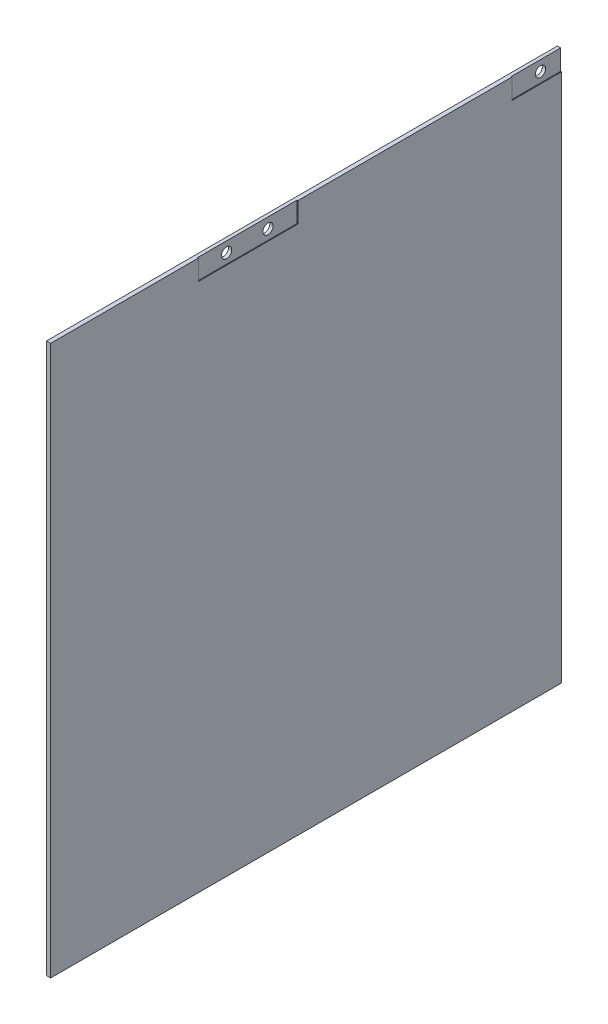
ISO-10303-21;
HEADER;
FILE_DESCRIPTION(('STEP AP214'),'2;1');
FILE_NAME('part.step','',(''),(''),'','','');
FILE_SCHEMA(('AUTOMOTIVE_DESIGN { 1 0 10303 214 1 1 1 1 }'));
ENDSEC;
DATA;
#1=APPLICATION_CONTEXT('core data for automotive mechanical design processes');
#2=APPLICATION_PROTOCOL_DEFINITION('international standard','automotive_design',2000,#1);
#3=PRODUCT_CONTEXT('',#1,'mechanical');
#4=PRODUCT('Part','Part','',(#3));
#5=PRODUCT_RELATED_PRODUCT_CATEGORY('part','',(#4));
#6=PRODUCT_DEFINITION_FORMATION('','',#4);
#7=PRODUCT_DEFINITION_CONTEXT('part definition',#1,'design');
#8=PRODUCT_DEFINITION('design','',#6,#7);
#9=PRODUCT_DEFINITION_SHAPE('','',#8);
#10=(LENGTH_UNIT() NAMED_UNIT(*) SI_UNIT(.MILLI.,.METRE.));
#11=(NAMED_UNIT(*) PLANE_ANGLE_UNIT() SI_UNIT($,.RADIAN.));
#12=(NAMED_UNIT(*) SI_UNIT($,.STERADIAN.) SOLID_ANGLE_UNIT());
#13=UNCERTAINTY_MEASURE_WITH_UNIT(LENGTH_MEASURE(1.E-05),#10,'distance_accuracy_value','');
#14=(GEOMETRIC_REPRESENTATION_CONTEXT(3) GLOBAL_UNCERTAINTY_ASSIGNED_CONTEXT((#13)) GLOBAL_UNIT_ASSIGNED_CONTEXT((#10,
#11,#12)) REPRESENTATION_CONTEXT('',''));
#15=CARTESIAN_POINT('',(0.,0.,0.));
#16=DIRECTION('',(0.,0.,1.));
#17=DIRECTION('',(1.,0.,0.));
#18=AXIS2_PLACEMENT_3D('',#15,#16,#17);
#19=CARTESIAN_POINT('',(160.,100.,-105.55));
#20=DIRECTION('',(-1.,0.,0.));
#21=DIRECTION('',(0.,0.,1.));
#22=AXIS2_PLACEMENT_3D('',#19,#20,#21);
#23=PLANE('',#22);
#24=DIRECTION('',(0.,-1.,0.));
#25=VECTOR('',#24,1.);
#26=CARTESIAN_POINT('',(160.,100.,79.4));
#27=LINE('',#26,#25);
#28=CARTESIAN_POINT('',(160.,100.,79.4));
#29=VERTEX_POINT('',#28);
#30=CARTESIAN_POINT('',(160.,-99.,79.4));
#31=VERTEX_POINT('',#30);
#32=EDGE_CURVE('E163',#29,#31,#27,.T.);
#33=ORIENTED_EDGE('',*,*,#32,.T.);
#34=DIRECTION('',(0.,0.,-1.));
#35=VECTOR('',#34,1.);
#36=CARTESIAN_POINT('',(160.,-99.,81.202775637732));
#37=LINE('',#36,#35);
#38=CARTESIAN_POINT('',(160.,-99.,-105.55));
#39=VERTEX_POINT('',#38);
#40=EDGE_CURVE('E48',#31,#39,#37,.T.);
#41=ORIENTED_EDGE('',*,*,#40,.T.);
#42=DIRECTION('',(0.,-1.,0.));
#43=VECTOR('',#42,1.);
#44=CARTESIAN_POINT('',(160.,100.,-105.55));
#45=LINE('',#44,#43);
#46=CARTESIAN_POINT('',(160.,92.65,-105.55));
#47=VERTEX_POINT('',#46);
#48=EDGE_CURVE('E165',#47,#39,#45,.T.);
#49=ORIENTED_EDGE('',*,*,#48,.F.);
#50=DIRECTION('',(0.,0.,-1.));
#51=VECTOR('',#50,1.);
#52=CARTESIAN_POINT('',(160.,92.65,-123.8));
#53=LINE('',#52,#51);
#54=CARTESIAN_POINT('',(160.,92.65,-87.7));
#55=VERTEX_POINT('',#54);
#56=EDGE_CURVE('E222',#55,#47,#53,.T.);
#57=ORIENTED_EDGE('',*,*,#56,.F.);
#58=DIRECTION('',(0.,-1.,0.));
#59=VECTOR('',#58,1.);
#60=CARTESIAN_POINT('',(160.,108.85,-87.7));
#61=LINE('',#60,#59);
#62=CARTESIAN_POINT('',(160.,100.,-87.7));
#63=VERTEX_POINT('',#62);
#64=EDGE_CURVE('E220',#63,#55,#61,.T.);
#65=ORIENTED_EDGE('',*,*,#64,.F.);
#66=DIRECTION('',(0.,0.,1.));
#67=VECTOR('',#66,1.);
#68=CARTESIAN_POINT('',(160.,100.,-105.55));
#69=LINE('',#68,#67);
#70=CARTESIAN_POINT('',(160.,100.,-10.15));
#71=VERTEX_POINT('',#70);
#72=EDGE_CURVE('E173',#63,#71,#69,.T.);
#73=ORIENTED_EDGE('',*,*,#72,.T.);
#74=DIRECTION('',(0.,1.,0.));
#75=VECTOR('',#74,1.);
#76=CARTESIAN_POINT('',(160.,108.85,-10.15));
#77=LINE('',#76,#75);
#78=CARTESIAN_POINT('',(160.,92.65,-10.15));
#79=VERTEX_POINT('',#78);
#80=EDGE_CURVE('E218',#79,#71,#77,.T.);
#81=ORIENTED_EDGE('',*,*,#80,.F.);
#82=DIRECTION('',(0.,0.,-1.));
#83=VECTOR('',#82,1.);
#84=CARTESIAN_POINT('',(160.,92.65,-10.15));
#85=LINE('',#84,#83);
#86=CARTESIAN_POINT('',(160.,92.65,25.95));
#87=VERTEX_POINT('',#86);
#88=EDGE_CURVE('E239',#87,#79,#85,.T.);
#89=ORIENTED_EDGE('',*,*,#88,.F.);
#90=DIRECTION('',(0.,-1.,0.));
#91=VECTOR('',#90,1.);
#92=CARTESIAN_POINT('',(160.,108.85,25.95));
#93=LINE('',#92,#91);
#94=CARTESIAN_POINT('',(160.,100.,25.95));
#95=VERTEX_POINT('',#94);
#96=EDGE_CURVE('E244',#95,#87,#93,.T.);
#97=ORIENTED_EDGE('',*,*,#96,.F.);
#98=EDGE_CURVE('E171',#95,#29,#69,.T.);
#99=ORIENTED_EDGE('',*,*,#98,.T.);
#100=EDGE_LOOP('',(#33,#41,#49,#57,#65,#73,#81,#89,#97,#99));
#101=FACE_BOUND('',#100,.T.);
#102=ADVANCED_FACE('F33',(#101),#23,.F.);
#103=CARTESIAN_POINT('',(158.5,100.,-105.55));
#104=DIRECTION('',(1.,0.,0.));
#105=DIRECTION('',(0.,1.,0.));
#106=AXIS2_PLACEMENT_3D('',#103,#104,#105);
#107=PLANE('',#106);
#108=CARTESIAN_POINT('',(158.5,96.25,-98.25));
#109=DIRECTION('',(1.,0.,0.));
#110=DIRECTION('',(0.,1.,0.));
#111=AXIS2_PLACEMENT_3D('',#108,#109,#110);
#112=CIRCLE('',#111,1.85000000000001);
#113=CARTESIAN_POINT('',(158.5,98.1,-98.25));
#114=VERTEX_POINT('',#113);
#115=EDGE_CURVE('E188',#114,#114,#112,.T.);
#116=ORIENTED_EDGE('',*,*,#115,.T.);
#117=EDGE_LOOP('',(#116));
#118=FACE_BOUND('',#117,.T.);
#119=CARTESIAN_POINT('',(158.5,96.25,0.400000000000005));
#120=DIRECTION('',(1.,0.,0.));
#121=DIRECTION('',(0.,1.,0.));
#122=AXIS2_PLACEMENT_3D('',#119,#120,#121);
#123=CIRCLE('',#122,1.85);
#124=CARTESIAN_POINT('',(158.5,98.1,0.400000000000005));
#125=VERTEX_POINT('',#124);
#126=EDGE_CURVE('E184',#125,#125,#123,.T.);
#127=ORIENTED_EDGE('',*,*,#126,.T.);
#128=EDGE_LOOP('',(#127));
#129=FACE_BOUND('',#128,.T.);
#130=CARTESIAN_POINT('',(158.5,96.25,15.4));
#131=DIRECTION('',(1.,0.,0.));
#132=DIRECTION('',(0.,1.,0.));
#133=AXIS2_PLACEMENT_3D('',#130,#131,#132);
#134=CIRCLE('',#133,1.85);
#135=CARTESIAN_POINT('',(158.5,98.1,15.4));
#136=VERTEX_POINT('',#135);
#137=EDGE_CURVE('E181',#136,#136,#134,.T.);
#138=ORIENTED_EDGE('',*,*,#137,.T.);
#139=EDGE_LOOP('',(#138));
#140=FACE_BOUND('',#139,.T.);
#141=DIRECTION('',(0.,1.,0.));
#142=VECTOR('',#141,1.);
#143=CARTESIAN_POINT('',(158.5,100.,-105.55));
#144=LINE('',#143,#142);
#145=CARTESIAN_POINT('',(158.5,-99.,-105.55));
#146=VERTEX_POINT('',#145);
#147=CARTESIAN_POINT('',(158.5,-25.,-105.55));
#148=VERTEX_POINT('',#147);
#149=EDGE_CURVE('E156',#146,#148,#144,.T.);
#150=ORIENTED_EDGE('',*,*,#149,.F.);
#151=DIRECTION('',(0.,0.,-1.));
#152=VECTOR('',#151,1.);
#153=CARTESIAN_POINT('',(158.5,-99.,81.202775637732));
#154=LINE('',#153,#152);
#155=CARTESIAN_POINT('',(158.5,-99.,79.4));
#156=VERTEX_POINT('',#155);
#157=EDGE_CURVE('E141',#156,#146,#154,.T.);
#158=ORIENTED_EDGE('',*,*,#157,.F.);
#159=DIRECTION('',(0.,1.,0.));
#160=VECTOR('',#159,1.);
#161=CARTESIAN_POINT('',(158.5,100.,79.4));
#162=LINE('',#161,#160);
#163=CARTESIAN_POINT('',(158.5,100.,79.4));
#164=VERTEX_POINT('',#163);
#165=EDGE_CURVE('E153',#156,#164,#162,.T.);
#166=ORIENTED_EDGE('',*,*,#165,.T.);
#167=DIRECTION('',(0.,0.,1.));
#168=VECTOR('',#167,1.);
#169=CARTESIAN_POINT('',(158.5,100.,-105.55));
#170=LINE('',#169,#168);
#171=CARTESIAN_POINT('',(158.5,100.,-105.55));
#172=VERTEX_POINT('',#171);
#173=EDGE_CURVE('E175',#172,#164,#170,.T.);
#174=ORIENTED_EDGE('',*,*,#173,.F.);
#175=CARTESIAN_POINT('',(158.5,25.,-105.55));
#176=VERTEX_POINT('',#175);
#177=EDGE_CURVE('E281',#176,#172,#144,.T.);
#178=ORIENTED_EDGE('',*,*,#177,.F.);
#179=DIRECTION('',(0.,0.,1.));
#180=VECTOR('',#179,1.);
#181=CARTESIAN_POINT('',(158.5,25.,-105.55));
#182=LINE('',#181,#180);
#183=CARTESIAN_POINT('',(158.5,25.,-104.05));
#184=VERTEX_POINT('',#183);
#185=EDGE_CURVE('E274',#176,#184,#182,.T.);
#186=ORIENTED_EDGE('',*,*,#185,.T.);
#187=DIRECTION('',(0.,-1.,0.));
#188=VECTOR('',#187,1.);
#189=CARTESIAN_POINT('',(158.5,100.,-104.05));
#190=LINE('',#189,#188);
#191=CARTESIAN_POINT('',(158.5,-25.,-104.05));
#192=VERTEX_POINT('',#191);
#193=EDGE_CURVE('E177',#184,#192,#190,.T.);
#194=ORIENTED_EDGE('',*,*,#193,.T.);
#195=DIRECTION('',(0.,0.,-1.));
#196=VECTOR('',#195,1.);
#197=CARTESIAN_POINT('',(158.5,-25.,-105.55));
#198=LINE('',#197,#196);
#199=EDGE_CURVE('E167',#192,#148,#198,.T.);
#200=ORIENTED_EDGE('',*,*,#199,.T.);
#201=EDGE_LOOP('',(#150,#158,#166,#174,#178,#186,#194,#200));
#202=FACE_BOUND('',#201,.T.);
#203=ADVANCED_FACE('F151',(#118,#129,#140,#202),#107,.F.);
#204=CARTESIAN_POINT('',(160.,100.,-105.55));
#205=DIRECTION('',(0.,-1.,0.));
#206=DIRECTION('',(0.,0.,-1.));
#207=AXIS2_PLACEMENT_3D('',#204,#205,#206);
#208=PLANE('',#207);
#209=ORIENTED_EDGE('',*,*,#72,.F.);
#210=DIRECTION('',(-1.,0.,0.));
#211=VECTOR('',#210,1.);
#212=CARTESIAN_POINT('',(160.,100.,-87.7));
#213=LINE('',#212,#211);
#214=CARTESIAN_POINT('',(159.7,100.,-87.7));
#215=VERTEX_POINT('',#214);
#216=EDGE_CURVE('E11',#63,#215,#213,.T.);
#217=ORIENTED_EDGE('',*,*,#216,.T.);
#218=DIRECTION('',(0.,0.,-1.));
#219=VECTOR('',#218,1.);
#220=CARTESIAN_POINT('',(159.7,100.,-105.55));
#221=LINE('',#220,#219);
#222=CARTESIAN_POINT('',(159.7,100.,-105.55));
#223=VERTEX_POINT('',#222);
#224=EDGE_CURVE('E201',#215,#223,#221,.T.);
#225=ORIENTED_EDGE('',*,*,#224,.T.);
#226=DIRECTION('',(1.,0.,0.));
#227=VECTOR('',#226,1.);
#228=CARTESIAN_POINT('',(160.,100.,-105.55));
#229=LINE('',#228,#227);
#230=EDGE_CURVE('E174',#172,#223,#229,.T.);
#231=ORIENTED_EDGE('',*,*,#230,.F.);
#232=ORIENTED_EDGE('',*,*,#173,.T.);
#233=DIRECTION('',(1.,0.,0.));
#234=VECTOR('',#233,1.);
#235=CARTESIAN_POINT('',(160.,100.,79.4));
#236=LINE('',#235,#234);
#237=EDGE_CURVE('E162',#164,#29,#236,.T.);
#238=ORIENTED_EDGE('',*,*,#237,.T.);
#239=ORIENTED_EDGE('',*,*,#98,.F.);
#240=DIRECTION('',(-1.,0.,0.));
#241=VECTOR('',#240,1.);
#242=CARTESIAN_POINT('',(160.,100.,25.95));
#243=LINE('',#242,#241);
#244=CARTESIAN_POINT('',(159.7,100.,25.95));
#245=VERTEX_POINT('',#244);
#246=EDGE_CURVE('E204',#95,#245,#243,.T.);
#247=ORIENTED_EDGE('',*,*,#246,.T.);
#248=DIRECTION('',(0.,0.,-1.));
#249=VECTOR('',#248,1.);
#250=CARTESIAN_POINT('',(159.7,100.,-105.55));
#251=LINE('',#250,#249);
#252=CARTESIAN_POINT('',(159.7,100.,-10.15));
#253=VERTEX_POINT('',#252);
#254=EDGE_CURVE('E185',#245,#253,#251,.T.);
#255=ORIENTED_EDGE('',*,*,#254,.T.);
#256=DIRECTION('',(1.,0.,0.));
#257=VECTOR('',#256,1.);
#258=CARTESIAN_POINT('',(160.,100.,-10.15));
#259=LINE('',#258,#257);
#260=EDGE_CURVE('E41',#253,#71,#259,.T.);
#261=ORIENTED_EDGE('',*,*,#260,.T.);
#262=EDGE_LOOP('',(#209,#217,#225,#231,#232,#238,#239,#247,#255,#261));
#263=FACE_BOUND('',#262,.T.);
#264=ADVANCED_FACE('F212',(#263),#208,.F.);
#265=CARTESIAN_POINT('',(0.,0.,-105.55));
#266=DIRECTION('',(0.,0.,-1.));
#267=DIRECTION('',(-1.,0.,0.));
#268=AXIS2_PLACEMENT_3D('',#265,#266,#267);
#269=PLANE('',#268);
#270=CARTESIAN_POINT('',(150.4,0.,-105.55));
#271=DIRECTION('',(0.,0.,-1.));
#272=DIRECTION('',(-1.,0.,0.));
#273=AXIS2_PLACEMENT_3D('',#270,#271,#272);
#274=CIRCLE('',#273,1.80000000000001);
#275=CARTESIAN_POINT('',(148.6,0.,-105.55));
#276=VERTEX_POINT('',#275);
#277=EDGE_CURVE('E157',#276,#276,#274,.T.);
#278=ORIENTED_EDGE('',*,*,#277,.F.);
#279=EDGE_LOOP('',(#278));
#280=FACE_BOUND('',#279,.T.);
#281=DIRECTION('',(1.,0.,0.));
#282=VECTOR('',#281,1.);
#283=CARTESIAN_POINT('',(0.,-99.,-105.55));
#284=LINE('',#283,#282);
#285=EDGE_CURVE('E147',#146,#39,#284,.T.);
#286=ORIENTED_EDGE('',*,*,#285,.F.);
#287=ORIENTED_EDGE('',*,*,#149,.T.);
#288=DIRECTION('',(-1.,0.,0.));
#289=VECTOR('',#288,1.);
#290=CARTESIAN_POINT('',(142.9,-25.,-105.55));
#291=LINE('',#290,#289);
#292=CARTESIAN_POINT('',(142.9,-25.,-105.55));
#293=VERTEX_POINT('',#292);
#294=EDGE_CURVE('E260',#148,#293,#291,.T.);
#295=ORIENTED_EDGE('',*,*,#294,.T.);
#296=DIRECTION('',(0.,1.,0.));
#297=VECTOR('',#296,1.);
#298=CARTESIAN_POINT('',(142.9,25.,-105.55));
#299=LINE('',#298,#297);
#300=CARTESIAN_POINT('',(142.9,25.,-105.55));
#301=VERTEX_POINT('',#300);
#302=EDGE_CURVE('E191',#293,#301,#299,.T.);
#303=ORIENTED_EDGE('',*,*,#302,.T.);
#304=DIRECTION('',(1.,0.,0.));
#305=VECTOR('',#304,1.);
#306=CARTESIAN_POINT('',(142.9,25.,-105.55));
#307=LINE('',#306,#305);
#308=EDGE_CURVE('E268',#301,#176,#307,.T.);
#309=ORIENTED_EDGE('',*,*,#308,.T.);
#310=ORIENTED_EDGE('',*,*,#177,.T.);
#311=ORIENTED_EDGE('',*,*,#230,.T.);
#312=DIRECTION('',(0.,1.,0.));
#313=VECTOR('',#312,1.);
#314=CARTESIAN_POINT('',(159.7,0.,-105.55));
#315=LINE('',#314,#313);
#316=CARTESIAN_POINT('',(159.7,92.65,-105.55));
#317=VERTEX_POINT('',#316);
#318=EDGE_CURVE('E195',#317,#223,#315,.T.);
#319=ORIENTED_EDGE('',*,*,#318,.F.);
#320=DIRECTION('',(-1.,0.,0.));
#321=VECTOR('',#320,1.);
#322=CARTESIAN_POINT('',(0.,92.65,-105.55));
#323=LINE('',#322,#321);
#324=EDGE_CURVE('E180',#47,#317,#323,.T.);
#325=ORIENTED_EDGE('',*,*,#324,.F.);
#326=ORIENTED_EDGE('',*,*,#48,.T.);
#327=EDGE_LOOP('',(#286,#287,#295,#303,#309,#310,#311,#319,#325,#326));
#328=FACE_BOUND('',#327,.T.);
#329=ADVANCED_FACE('F286',(#280,#328),#269,.T.);
#330=CARTESIAN_POINT('',(0.,0.,79.4));
#331=DIRECTION('',(0.,0.,-1.));
#332=DIRECTION('',(-1.,0.,0.));
#333=AXIS2_PLACEMENT_3D('',#330,#331,#332);
#334=PLANE('',#333);
#335=ORIENTED_EDGE('',*,*,#165,.F.);
#336=DIRECTION('',(-1.,0.,0.));
#337=VECTOR('',#336,1.);
#338=CARTESIAN_POINT('',(160.,-99.,79.4));
#339=LINE('',#338,#337);
#340=EDGE_CURVE('E138',#31,#156,#339,.T.);
#341=ORIENTED_EDGE('',*,*,#340,.F.);
#342=ORIENTED_EDGE('',*,*,#32,.F.);
#343=ORIENTED_EDGE('',*,*,#237,.F.);
#344=EDGE_LOOP('',(#335,#341,#342,#343));
#345=FACE_BOUND('',#344,.T.);
#346=ADVANCED_FACE('F160',(#345),#334,.F.);
#347=CARTESIAN_POINT('',(0.,0.,-104.05));
#348=DIRECTION('',(0.,0.,1.));
#349=DIRECTION('',(1.,0.,0.));
#350=AXIS2_PLACEMENT_3D('',#347,#348,#349);
#351=PLANE('',#350);
#352=CARTESIAN_POINT('',(150.4,0.,-104.05));
#353=DIRECTION('',(0.,0.,1.));
#354=DIRECTION('',(1.,0.,0.));
#355=AXIS2_PLACEMENT_3D('',#352,#353,#354);
#356=CIRCLE('',#355,1.80000000000001);
#357=CARTESIAN_POINT('',(152.2,0.,-104.05));
#358=VERTEX_POINT('',#357);
#359=EDGE_CURVE('E36',#358,#358,#356,.T.);
#360=ORIENTED_EDGE('',*,*,#359,.F.);
#361=EDGE_LOOP('',(#360));
#362=FACE_BOUND('',#361,.T.);
#363=ORIENTED_EDGE('',*,*,#193,.F.);
#364=DIRECTION('',(1.,0.,0.));
#365=VECTOR('',#364,1.);
#366=CARTESIAN_POINT('',(142.9,25.,-104.05));
#367=LINE('',#366,#365);
#368=CARTESIAN_POINT('',(142.9,25.,-104.05));
#369=VERTEX_POINT('',#368);
#370=EDGE_CURVE('E259',#369,#184,#367,.T.);
#371=ORIENTED_EDGE('',*,*,#370,.F.);
#372=DIRECTION('',(0.,1.,0.));
#373=VECTOR('',#372,1.);
#374=CARTESIAN_POINT('',(142.9,25.,-104.05));
#375=LINE('',#374,#373);
#376=CARTESIAN_POINT('',(142.9,-25.,-104.05));
#377=VERTEX_POINT('',#376);
#378=EDGE_CURVE('E256',#377,#369,#375,.T.);
#379=ORIENTED_EDGE('',*,*,#378,.F.);
#380=DIRECTION('',(-1.,0.,0.));
#381=VECTOR('',#380,1.);
#382=CARTESIAN_POINT('',(142.9,-25.,-104.05));
#383=LINE('',#382,#381);
#384=EDGE_CURVE('E263',#192,#377,#383,.T.);
#385=ORIENTED_EDGE('',*,*,#384,.F.);
#386=EDGE_LOOP('',(#363,#371,#379,#385));
#387=FACE_BOUND('',#386,.T.);
#388=ADVANCED_FACE('F305',(#362,#387),#351,.T.);
#389=CARTESIAN_POINT('',(142.9,-25.,-104.05));
#390=DIRECTION('',(0.,-1.,0.));
#391=DIRECTION('',(1.,0.,0.));
#392=AXIS2_PLACEMENT_3D('',#389,#390,#391);
#393=PLANE('',#392);
#394=ORIENTED_EDGE('',*,*,#199,.F.);
#395=ORIENTED_EDGE('',*,*,#384,.T.);
#396=DIRECTION('',(0.,0.,-1.));
#397=VECTOR('',#396,1.);
#398=CARTESIAN_POINT('',(142.9,-25.,-104.05));
#399=LINE('',#398,#397);
#400=EDGE_CURVE('E271',#377,#293,#399,.T.);
#401=ORIENTED_EDGE('',*,*,#400,.T.);
#402=ORIENTED_EDGE('',*,*,#294,.F.);
#403=EDGE_LOOP('',(#394,#395,#401,#402));
#404=FACE_BOUND('',#403,.T.);
#405=ADVANCED_FACE('F308',(#404),#393,.T.);
#406=CARTESIAN_POINT('',(142.9,25.,-104.05));
#407=DIRECTION('',(0.,1.,0.));
#408=DIRECTION('',(0.,0.,1.));
#409=AXIS2_PLACEMENT_3D('',#406,#407,#408);
#410=PLANE('',#409);
#411=ORIENTED_EDGE('',*,*,#185,.F.);
#412=ORIENTED_EDGE('',*,*,#308,.F.);
#413=DIRECTION('',(0.,0.,-1.));
#414=VECTOR('',#413,1.);
#415=CARTESIAN_POINT('',(142.9,25.,-104.05));
#416=LINE('',#415,#414);
#417=EDGE_CURVE('E265',#369,#301,#416,.T.);
#418=ORIENTED_EDGE('',*,*,#417,.F.);
#419=ORIENTED_EDGE('',*,*,#370,.T.);
#420=EDGE_LOOP('',(#411,#412,#418,#419));
#421=FACE_BOUND('',#420,.T.);
#422=ADVANCED_FACE('F315',(#421),#410,.T.);
#423=CARTESIAN_POINT('',(142.9,25.,-104.05));
#424=DIRECTION('',(-1.,0.,0.));
#425=DIRECTION('',(0.,0.,1.));
#426=AXIS2_PLACEMENT_3D('',#423,#424,#425);
#427=PLANE('',#426);
#428=ORIENTED_EDGE('',*,*,#302,.F.);
#429=ORIENTED_EDGE('',*,*,#400,.F.);
#430=ORIENTED_EDGE('',*,*,#378,.T.);
#431=ORIENTED_EDGE('',*,*,#417,.T.);
#432=EDGE_LOOP('',(#428,#429,#430,#431));
#433=FACE_BOUND('',#432,.T.);
#434=ADVANCED_FACE('F319',(#433),#427,.T.);
#435=CARTESIAN_POINT('',(155.,96.25,15.4));
#436=DIRECTION('',(1.,0.,0.));
#437=DIRECTION('',(0.,0.,-1.));
#438=AXIS2_PLACEMENT_3D('',#435,#436,#437);
#439=CYLINDRICAL_SURFACE('',#438,1.85);
#440=CARTESIAN_POINT('',(159.7,96.25,15.4));
#441=DIRECTION('',(-1.,0.,0.));
#442=DIRECTION('',(0.,0.,1.));
#443=AXIS2_PLACEMENT_3D('',#440,#441,#442);
#444=CIRCLE('',#443,1.85);
#445=CARTESIAN_POINT('',(159.7,96.25,17.25));
#446=VERTEX_POINT('',#445);
#447=EDGE_CURVE('E200',#446,#446,#444,.F.);
#448=ORIENTED_EDGE('',*,*,#447,.T.);
#449=EDGE_LOOP('',(#448));
#450=FACE_BOUND('',#449,.T.);
#451=ORIENTED_EDGE('',*,*,#137,.F.);
#452=EDGE_LOOP('',(#451));
#453=FACE_BOUND('',#452,.T.);
#454=ADVANCED_FACE('F363',(#450,#453),#439,.F.);
#455=CARTESIAN_POINT('',(155.,96.25,0.400000000000005));
#456=DIRECTION('',(1.,0.,0.));
#457=DIRECTION('',(0.,0.,-1.));
#458=AXIS2_PLACEMENT_3D('',#455,#456,#457);
#459=CYLINDRICAL_SURFACE('',#458,1.85);
#460=CARTESIAN_POINT('',(159.7,96.25,0.400000000000005));
#461=DIRECTION('',(-1.,0.,0.));
#462=DIRECTION('',(0.,0.,1.));
#463=AXIS2_PLACEMENT_3D('',#460,#461,#462);
#464=CIRCLE('',#463,1.85);
#465=CARTESIAN_POINT('',(159.7,96.25,2.25000000000001));
#466=VERTEX_POINT('',#465);
#467=EDGE_CURVE('E197',#466,#466,#464,.F.);
#468=ORIENTED_EDGE('',*,*,#467,.T.);
#469=EDGE_LOOP('',(#468));
#470=FACE_BOUND('',#469,.T.);
#471=ORIENTED_EDGE('',*,*,#126,.F.);
#472=EDGE_LOOP('',(#471));
#473=FACE_BOUND('',#472,.T.);
#474=ADVANCED_FACE('F370',(#470,#473),#459,.F.);
#475=CARTESIAN_POINT('',(155.,96.25,-98.25));
#476=DIRECTION('',(1.,0.,0.));
#477=DIRECTION('',(0.,0.,-1.));
#478=AXIS2_PLACEMENT_3D('',#475,#476,#477);
#479=CYLINDRICAL_SURFACE('',#478,1.85000000000001);
#480=CARTESIAN_POINT('',(159.7,96.25,-98.25));
#481=DIRECTION('',(-1.,0.,0.));
#482=DIRECTION('',(0.,0.,1.));
#483=AXIS2_PLACEMENT_3D('',#480,#481,#482);
#484=CIRCLE('',#483,1.85000000000001);
#485=CARTESIAN_POINT('',(159.7,96.25,-96.4));
#486=VERTEX_POINT('',#485);
#487=EDGE_CURVE('E192',#486,#486,#484,.F.);
#488=ORIENTED_EDGE('',*,*,#487,.T.);
#489=EDGE_LOOP('',(#488));
#490=FACE_BOUND('',#489,.T.);
#491=ORIENTED_EDGE('',*,*,#115,.F.);
#492=EDGE_LOOP('',(#491));
#493=FACE_BOUND('',#492,.T.);
#494=ADVANCED_FACE('F373',(#490,#493),#479,.F.);
#495=CARTESIAN_POINT('',(159.7,108.85,-87.7));
#496=DIRECTION('',(0.,0.,1.));
#497=DIRECTION('',(1.,0.,0.));
#498=AXIS2_PLACEMENT_3D('',#495,#496,#497);
#499=PLANE('',#498);
#500=ORIENTED_EDGE('',*,*,#64,.T.);
#501=DIRECTION('',(1.,0.,0.));
#502=VECTOR('',#501,1.);
#503=CARTESIAN_POINT('',(159.7,92.65,-87.7));
#504=LINE('',#503,#502);
#505=CARTESIAN_POINT('',(159.7,92.65,-87.7));
#506=VERTEX_POINT('',#505);
#507=EDGE_CURVE('E196',#506,#55,#504,.T.);
#508=ORIENTED_EDGE('',*,*,#507,.F.);
#509=DIRECTION('',(0.,-1.,0.));
#510=VECTOR('',#509,1.);
#511=CARTESIAN_POINT('',(159.7,108.85,-87.7));
#512=LINE('',#511,#510);
#513=EDGE_CURVE('E228',#215,#506,#512,.T.);
#514=ORIENTED_EDGE('',*,*,#513,.F.);
#515=ORIENTED_EDGE('',*,*,#216,.F.);
#516=EDGE_LOOP('',(#500,#508,#514,#515));
#517=FACE_BOUND('',#516,.T.);
#518=ADVANCED_FACE('F292',(#517),#499,.F.);
#519=CARTESIAN_POINT('',(159.7,0.,0.));
#520=DIRECTION('',(-1.,0.,0.));
#521=DIRECTION('',(0.,0.,1.));
#522=AXIS2_PLACEMENT_3D('',#519,#520,#521);
#523=PLANE('',#522);
#524=ORIENTED_EDGE('',*,*,#487,.F.);
#525=EDGE_LOOP('',(#524));
#526=FACE_BOUND('',#525,.T.);
#527=ORIENTED_EDGE('',*,*,#513,.T.);
#528=DIRECTION('',(0.,0.,-1.));
#529=VECTOR('',#528,1.);
#530=CARTESIAN_POINT('',(159.7,92.65,-123.8));
#531=LINE('',#530,#529);
#532=EDGE_CURVE('E233',#506,#317,#531,.T.);
#533=ORIENTED_EDGE('',*,*,#532,.T.);
#534=ORIENTED_EDGE('',*,*,#318,.T.);
#535=ORIENTED_EDGE('',*,*,#224,.F.);
#536=EDGE_LOOP('',(#527,#533,#534,#535));
#537=FACE_BOUND('',#536,.T.);
#538=ADVANCED_FACE('F291',(#526,#537),#523,.F.);
#539=CARTESIAN_POINT('',(159.7,92.65,-123.8));
#540=DIRECTION('',(0.,-1.,0.));
#541=DIRECTION('',(0.,0.,-1.));
#542=AXIS2_PLACEMENT_3D('',#539,#540,#541);
#543=PLANE('',#542);
#544=ORIENTED_EDGE('',*,*,#324,.T.);
#545=ORIENTED_EDGE('',*,*,#532,.F.);
#546=ORIENTED_EDGE('',*,*,#507,.T.);
#547=ORIENTED_EDGE('',*,*,#56,.T.);
#548=EDGE_LOOP('',(#544,#545,#546,#547));
#549=FACE_BOUND('',#548,.T.);
#550=ADVANCED_FACE('F335',(#549),#543,.F.);
#551=CARTESIAN_POINT('',(159.7,108.85,-10.15));
#552=DIRECTION('',(0.,0.,-1.));
#553=DIRECTION('',(-1.,0.,0.));
#554=AXIS2_PLACEMENT_3D('',#551,#552,#553);
#555=PLANE('',#554);
#556=DIRECTION('',(0.,1.,0.));
#557=VECTOR('',#556,1.);
#558=CARTESIAN_POINT('',(159.7,108.85,-10.15));
#559=LINE('',#558,#557);
#560=CARTESIAN_POINT('',(159.7,92.65,-10.15));
#561=VERTEX_POINT('',#560);
#562=EDGE_CURVE('E56',#561,#253,#559,.T.);
#563=ORIENTED_EDGE('',*,*,#562,.F.);
#564=DIRECTION('',(1.,0.,0.));
#565=VECTOR('',#564,1.);
#566=CARTESIAN_POINT('',(159.7,92.65,-10.15));
#567=LINE('',#566,#565);
#568=EDGE_CURVE('E226',#561,#79,#567,.T.);
#569=ORIENTED_EDGE('',*,*,#568,.T.);
#570=ORIENTED_EDGE('',*,*,#80,.T.);
#571=ORIENTED_EDGE('',*,*,#260,.F.);
#572=EDGE_LOOP('',(#563,#569,#570,#571));
#573=FACE_BOUND('',#572,.T.);
#574=ADVANCED_FACE('F333',(#573),#555,.F.);
#575=CARTESIAN_POINT('',(159.7,108.85,25.95));
#576=DIRECTION('',(0.,0.,1.));
#577=DIRECTION('',(1.,0.,0.));
#578=AXIS2_PLACEMENT_3D('',#575,#576,#577);
#579=PLANE('',#578);
#580=ORIENTED_EDGE('',*,*,#96,.T.);
#581=DIRECTION('',(1.,0.,0.));
#582=VECTOR('',#581,1.);
#583=CARTESIAN_POINT('',(159.7,92.65,25.95));
#584=LINE('',#583,#582);
#585=CARTESIAN_POINT('',(159.7,92.65,25.95));
#586=VERTEX_POINT('',#585);
#587=EDGE_CURVE('E230',#586,#87,#584,.T.);
#588=ORIENTED_EDGE('',*,*,#587,.F.);
#589=DIRECTION('',(0.,-1.,0.));
#590=VECTOR('',#589,1.);
#591=CARTESIAN_POINT('',(159.7,108.85,25.95));
#592=LINE('',#591,#590);
#593=EDGE_CURVE('E238',#245,#586,#592,.T.);
#594=ORIENTED_EDGE('',*,*,#593,.F.);
#595=ORIENTED_EDGE('',*,*,#246,.F.);
#596=EDGE_LOOP('',(#580,#588,#594,#595));
#597=FACE_BOUND('',#596,.T.);
#598=ADVANCED_FACE('F327',(#597),#579,.F.);
#599=CARTESIAN_POINT('',(159.7,0.,0.));
#600=DIRECTION('',(-1.,0.,0.));
#601=DIRECTION('',(0.,0.,1.));
#602=AXIS2_PLACEMENT_3D('',#599,#600,#601);
#603=PLANE('',#602);
#604=ORIENTED_EDGE('',*,*,#467,.F.);
#605=EDGE_LOOP('',(#604));
#606=FACE_BOUND('',#605,.T.);
#607=ORIENTED_EDGE('',*,*,#447,.F.);
#608=EDGE_LOOP('',(#607));
#609=FACE_BOUND('',#608,.T.);
#610=ORIENTED_EDGE('',*,*,#593,.T.);
#611=DIRECTION('',(0.,0.,-1.));
#612=VECTOR('',#611,1.);
#613=CARTESIAN_POINT('',(159.7,92.65,-10.15));
#614=LINE('',#613,#612);
#615=EDGE_CURVE('E241',#586,#561,#614,.T.);
#616=ORIENTED_EDGE('',*,*,#615,.T.);
#617=ORIENTED_EDGE('',*,*,#562,.T.);
#618=ORIENTED_EDGE('',*,*,#254,.F.);
#619=EDGE_LOOP('',(#610,#616,#617,#618));
#620=FACE_BOUND('',#619,.T.);
#621=ADVANCED_FACE('F330',(#606,#609,#620),#603,.F.);
#622=CARTESIAN_POINT('',(159.7,92.65,-10.15));
#623=DIRECTION('',(0.,-1.,0.));
#624=DIRECTION('',(0.,0.,-1.));
#625=AXIS2_PLACEMENT_3D('',#622,#623,#624);
#626=PLANE('',#625);
#627=ORIENTED_EDGE('',*,*,#88,.T.);
#628=ORIENTED_EDGE('',*,*,#568,.F.);
#629=ORIENTED_EDGE('',*,*,#615,.F.);
#630=ORIENTED_EDGE('',*,*,#587,.T.);
#631=EDGE_LOOP('',(#627,#628,#629,#630));
#632=FACE_BOUND('',#631,.T.);
#633=ADVANCED_FACE('F332',(#632),#626,.F.);
#634=CARTESIAN_POINT('',(160.,-99.,81.202775637732));
#635=DIRECTION('',(0.,1.,0.));
#636=DIRECTION('',(0.,0.,1.));
#637=AXIS2_PLACEMENT_3D('',#634,#635,#636);
#638=PLANE('',#637);
#639=ORIENTED_EDGE('',*,*,#285,.T.);
#640=ORIENTED_EDGE('',*,*,#40,.F.);
#641=ORIENTED_EDGE('',*,*,#340,.T.);
#642=ORIENTED_EDGE('',*,*,#157,.T.);
#643=EDGE_LOOP('',(#639,#640,#641,#642));
#644=FACE_BOUND('',#643,.T.);
#645=ADVANCED_FACE('F140',(#644),#638,.F.);
#646=CARTESIAN_POINT('',(150.4,0.,-97.55));
#647=DIRECTION('',(0.,0.,-1.));
#648=DIRECTION('',(-1.,0.,0.));
#649=AXIS2_PLACEMENT_3D('',#646,#647,#648);
#650=CYLINDRICAL_SURFACE('',#649,1.80000000000001);
#651=ORIENTED_EDGE('',*,*,#277,.T.);
#652=EDGE_LOOP('',(#651));
#653=FACE_BOUND('',#652,.T.);
#654=ORIENTED_EDGE('',*,*,#359,.T.);
#655=EDGE_LOOP('',(#654));
#656=FACE_BOUND('',#655,.T.);
#657=ADVANCED_FACE('F303',(#653,#656),#650,.F.);
#658=CLOSED_SHELL('',(#102,#203,#264,#329,#346,#388,#405,#422,#434,#454,#474,#494,#518,#538,
#550,#574,#598,#621,#633,#645,#657));
#659=MANIFOLD_SOLID_BREP('B2',#658);
#660=ADVANCED_BREP_SHAPE_REPRESENTATION('',(#18,#659),#14);
#661=SHAPE_DEFINITION_REPRESENTATION(#9,#660);
ENDSEC;
END-ISO-10303-21;
